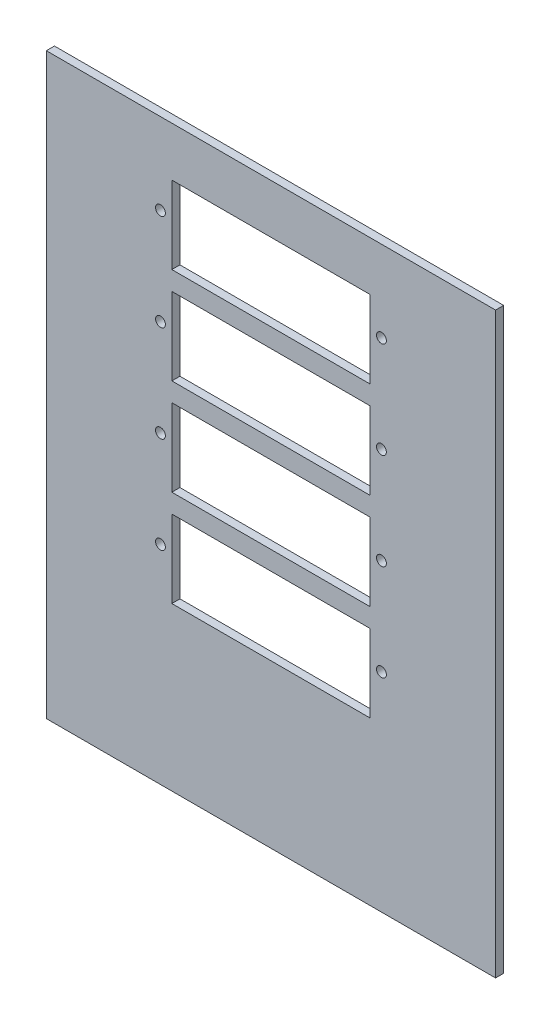
ISO-10303-21;
HEADER;
FILE_DESCRIPTION(('STEP AP214'),'2;1');
FILE_NAME('part.step','',(''),(''),'','','');
FILE_SCHEMA(('AUTOMOTIVE_DESIGN { 1 0 10303 214 1 1 1 1 }'));
ENDSEC;
DATA;
#1=APPLICATION_CONTEXT('core data for automotive mechanical design processes');
#2=APPLICATION_PROTOCOL_DEFINITION('international standard','automotive_design',2000,#1);
#3=PRODUCT_CONTEXT('',#1,'mechanical');
#4=PRODUCT('Part','Part','',(#3));
#5=PRODUCT_RELATED_PRODUCT_CATEGORY('part','',(#4));
#6=PRODUCT_DEFINITION_FORMATION('','',#4);
#7=PRODUCT_DEFINITION_CONTEXT('part definition',#1,'design');
#8=PRODUCT_DEFINITION('design','',#6,#7);
#9=PRODUCT_DEFINITION_SHAPE('','',#8);
#10=(LENGTH_UNIT() NAMED_UNIT(*) SI_UNIT(.MILLI.,.METRE.));
#11=(NAMED_UNIT(*) PLANE_ANGLE_UNIT() SI_UNIT($,.RADIAN.));
#12=(NAMED_UNIT(*) SI_UNIT($,.STERADIAN.) SOLID_ANGLE_UNIT());
#13=UNCERTAINTY_MEASURE_WITH_UNIT(LENGTH_MEASURE(1.E-05),#10,'distance_accuracy_value','');
#14=(GEOMETRIC_REPRESENTATION_CONTEXT(3) GLOBAL_UNCERTAINTY_ASSIGNED_CONTEXT((#13)) GLOBAL_UNIT_ASSIGNED_CONTEXT((#10,
#11,#12)) REPRESENTATION_CONTEXT('',''));
#15=CARTESIAN_POINT('',(0.,0.,0.));
#16=DIRECTION('',(0.,0.,1.));
#17=DIRECTION('',(1.,0.,0.));
#18=AXIS2_PLACEMENT_3D('',#15,#16,#17);
#19=CARTESIAN_POINT('',(-161.832061068702,173.5368956743,4.2));
#20=DIRECTION('',(1.,0.,0.));
#21=DIRECTION('',(0.,1.,0.));
#22=AXIS2_PLACEMENT_3D('',#19,#20,#21);
#23=PLANE('',#22);
#24=DIRECTION('',(0.,-1.,0.));
#25=VECTOR('',#24,1.);
#26=CARTESIAN_POINT('',(-161.832061068702,173.5368956743,0.));
#27=LINE('',#26,#25);
#28=CARTESIAN_POINT('',(-161.832061068702,173.5368956743,0.));
#29=VERTEX_POINT('',#28);
#30=CARTESIAN_POINT('',(-161.832061068702,-126.4631043257,0.));
#31=VERTEX_POINT('',#30);
#32=EDGE_CURVE('E339',#29,#31,#27,.T.);
#33=ORIENTED_EDGE('',*,*,#32,.T.);
#34=DIRECTION('',(0.,0.,-1.));
#35=VECTOR('',#34,1.);
#36=CARTESIAN_POINT('',(-161.832061068702,-126.4631043257,4.2));
#37=LINE('',#36,#35);
#38=CARTESIAN_POINT('',(-161.832061068702,-126.4631043257,4.2));
#39=VERTEX_POINT('',#38);
#40=EDGE_CURVE('E11',#39,#31,#37,.T.);
#41=ORIENTED_EDGE('',*,*,#40,.F.);
#42=DIRECTION('',(0.,-1.,0.));
#43=VECTOR('',#42,1.);
#44=CARTESIAN_POINT('',(-161.832061068702,173.5368956743,4.2));
#45=LINE('',#44,#43);
#46=CARTESIAN_POINT('',(-161.832061068702,173.5368956743,4.2));
#47=VERTEX_POINT('',#46);
#48=EDGE_CURVE('E340',#47,#39,#45,.T.);
#49=ORIENTED_EDGE('',*,*,#48,.F.);
#50=DIRECTION('',(0.,0.,-1.));
#51=VECTOR('',#50,1.);
#52=CARTESIAN_POINT('',(-161.832061068702,173.5368956743,4.2));
#53=LINE('',#52,#51);
#54=EDGE_CURVE('E350',#47,#29,#53,.T.);
#55=ORIENTED_EDGE('',*,*,#54,.T.);
#56=EDGE_LOOP('',(#33,#41,#49,#55));
#57=FACE_BOUND('',#56,.T.);
#58=ADVANCED_FACE('F37',(#57),#23,.F.);
#59=CARTESIAN_POINT('',(-161.832061068702,-126.4631043257,4.2));
#60=DIRECTION('',(0.,1.,0.));
#61=DIRECTION('',(0.,0.,1.));
#62=AXIS2_PLACEMENT_3D('',#59,#60,#61);
#63=PLANE('',#62);
#64=DIRECTION('',(1.,0.,0.));
#65=VECTOR('',#64,1.);
#66=CARTESIAN_POINT('',(-161.832061068702,-126.4631043257,0.));
#67=LINE('',#66,#65);
#68=CARTESIAN_POINT('',(71.1679389312977,-126.4631043257,0.));
#69=VERTEX_POINT('',#68);
#70=EDGE_CURVE('E353',#31,#69,#67,.T.);
#71=ORIENTED_EDGE('',*,*,#70,.T.);
#72=DIRECTION('',(0.,0.,-1.));
#73=VECTOR('',#72,1.);
#74=CARTESIAN_POINT('',(71.1679389312977,-126.4631043257,4.2));
#75=LINE('',#74,#73);
#76=CARTESIAN_POINT('',(71.1679389312977,-126.4631043257,4.2));
#77=VERTEX_POINT('',#76);
#78=EDGE_CURVE('E44',#77,#69,#75,.T.);
#79=ORIENTED_EDGE('',*,*,#78,.F.);
#80=DIRECTION('',(1.,0.,0.));
#81=VECTOR('',#80,1.);
#82=CARTESIAN_POINT('',(-161.832061068702,-126.4631043257,4.2));
#83=LINE('',#82,#81);
#84=EDGE_CURVE('E343',#39,#77,#83,.T.);
#85=ORIENTED_EDGE('',*,*,#84,.F.);
#86=ORIENTED_EDGE('',*,*,#40,.T.);
#87=EDGE_LOOP('',(#71,#79,#85,#86));
#88=FACE_BOUND('',#87,.T.);
#89=ADVANCED_FACE('F382',(#88),#63,.F.);
#90=CARTESIAN_POINT('',(71.1679389312977,173.5368956743,4.2));
#91=DIRECTION('',(-1.,0.,0.));
#92=DIRECTION('',(0.,-1.,0.));
#93=AXIS2_PLACEMENT_3D('',#90,#91,#92);
#94=PLANE('',#93);
#95=DIRECTION('',(0.,1.,0.));
#96=VECTOR('',#95,1.);
#97=CARTESIAN_POINT('',(71.1679389312977,173.5368956743,0.));
#98=LINE('',#97,#96);
#99=CARTESIAN_POINT('',(71.1679389312977,173.5368956743,0.));
#100=VERTEX_POINT('',#99);
#101=EDGE_CURVE('E355',#69,#100,#98,.T.);
#102=ORIENTED_EDGE('',*,*,#101,.T.);
#103=DIRECTION('',(0.,0.,-1.));
#104=VECTOR('',#103,1.);
#105=CARTESIAN_POINT('',(71.1679389312977,173.5368956743,4.2));
#106=LINE('',#105,#104);
#107=CARTESIAN_POINT('',(71.1679389312977,173.5368956743,4.2));
#108=VERTEX_POINT('',#107);
#109=EDGE_CURVE('E360',#108,#100,#106,.T.);
#110=ORIENTED_EDGE('',*,*,#109,.F.);
#111=DIRECTION('',(0.,1.,0.));
#112=VECTOR('',#111,1.);
#113=CARTESIAN_POINT('',(71.1679389312977,173.5368956743,4.2));
#114=LINE('',#113,#112);
#115=EDGE_CURVE('E346',#77,#108,#114,.T.);
#116=ORIENTED_EDGE('',*,*,#115,.F.);
#117=ORIENTED_EDGE('',*,*,#78,.T.);
#118=EDGE_LOOP('',(#102,#110,#116,#117));
#119=FACE_BOUND('',#118,.T.);
#120=ADVANCED_FACE('F367',(#119),#94,.F.);
#121=CARTESIAN_POINT('',(-161.832061068702,173.5368956743,4.2));
#122=DIRECTION('',(0.,-1.,0.));
#123=DIRECTION('',(0.,0.,-1.));
#124=AXIS2_PLACEMENT_3D('',#121,#122,#123);
#125=PLANE('',#124);
#126=DIRECTION('',(-1.,0.,0.));
#127=VECTOR('',#126,1.);
#128=CARTESIAN_POINT('',(-161.832061068702,173.5368956743,0.));
#129=LINE('',#128,#127);
#130=EDGE_CURVE('E344',#100,#29,#129,.T.);
#131=ORIENTED_EDGE('',*,*,#130,.T.);
#132=ORIENTED_EDGE('',*,*,#54,.F.);
#133=DIRECTION('',(-1.,0.,0.));
#134=VECTOR('',#133,1.);
#135=CARTESIAN_POINT('',(-161.832061068702,173.5368956743,4.2));
#136=LINE('',#135,#134);
#137=EDGE_CURVE('E348',#108,#47,#136,.T.);
#138=ORIENTED_EDGE('',*,*,#137,.F.);
#139=ORIENTED_EDGE('',*,*,#109,.T.);
#140=EDGE_LOOP('',(#131,#132,#138,#139));
#141=FACE_BOUND('',#140,.T.);
#142=ADVANCED_FACE('F375',(#141),#125,.F.);
#143=CARTESIAN_POINT('',(0.,0.,4.2));
#144=DIRECTION('',(0.,0.,1.));
#145=DIRECTION('',(1.,0.,0.));
#146=AXIS2_PLACEMENT_3D('',#143,#144,#145);
#147=PLANE('',#146);
#148=CARTESIAN_POINT('',(11.9679389312977,131.4268956743,4.2));
#149=DIRECTION('',(0.,0.,1.));
#150=DIRECTION('',(1.,0.,0.));
#151=AXIS2_PLACEMENT_3D('',#148,#149,#150);
#152=CIRCLE('',#151,2.54999999999999);
#153=CARTESIAN_POINT('',(14.5179389312977,131.4268956743,4.2));
#154=VERTEX_POINT('',#153);
#155=EDGE_CURVE('E336',#154,#154,#152,.T.);
#156=ORIENTED_EDGE('',*,*,#155,.F.);
#157=EDGE_LOOP('',(#156));
#158=FACE_BOUND('',#157,.T.);
#159=CARTESIAN_POINT('',(-102.632061068702,81.4268956743003,4.2));
#160=DIRECTION('',(0.,0.,1.));
#161=DIRECTION('',(1.,0.,0.));
#162=AXIS2_PLACEMENT_3D('',#159,#160,#161);
#163=CIRCLE('',#162,2.54999999999999);
#164=CARTESIAN_POINT('',(-100.082061068702,81.4268956743003,4.2));
#165=VERTEX_POINT('',#164);
#166=EDGE_CURVE('E333',#165,#165,#163,.T.);
#167=ORIENTED_EDGE('',*,*,#166,.F.);
#168=EDGE_LOOP('',(#167));
#169=FACE_BOUND('',#168,.T.);
#170=CARTESIAN_POINT('',(11.9679389312977,81.4268956743003,4.2));
#171=DIRECTION('',(0.,0.,1.));
#172=DIRECTION('',(1.,0.,0.));
#173=AXIS2_PLACEMENT_3D('',#170,#171,#172);
#174=CIRCLE('',#173,2.55);
#175=CARTESIAN_POINT('',(14.5179389312977,81.4268956743003,4.2));
#176=VERTEX_POINT('',#175);
#177=EDGE_CURVE('E330',#176,#176,#174,.T.);
#178=ORIENTED_EDGE('',*,*,#177,.F.);
#179=EDGE_LOOP('',(#178));
#180=FACE_BOUND('',#179,.T.);
#181=CARTESIAN_POINT('',(-102.632061068702,31.4268956743003,4.2));
#182=DIRECTION('',(0.,0.,1.));
#183=DIRECTION('',(1.,0.,0.));
#184=AXIS2_PLACEMENT_3D('',#181,#182,#183);
#185=CIRCLE('',#184,2.54999999999999);
#186=CARTESIAN_POINT('',(-100.082061068702,31.4268956743003,4.2));
#187=VERTEX_POINT('',#186);
#188=EDGE_CURVE('E327',#187,#187,#185,.T.);
#189=ORIENTED_EDGE('',*,*,#188,.F.);
#190=EDGE_LOOP('',(#189));
#191=FACE_BOUND('',#190,.T.);
#192=CARTESIAN_POINT('',(-102.632061068702,131.4268956743,4.2));
#193=DIRECTION('',(0.,0.,1.));
#194=DIRECTION('',(1.,0.,0.));
#195=AXIS2_PLACEMENT_3D('',#192,#193,#194);
#196=CIRCLE('',#195,2.54999999999999);
#197=CARTESIAN_POINT('',(-100.082061068702,131.4268956743,4.2));
#198=VERTEX_POINT('',#197);
#199=EDGE_CURVE('E324',#198,#198,#196,.T.);
#200=ORIENTED_EDGE('',*,*,#199,.F.);
#201=EDGE_LOOP('',(#200));
#202=FACE_BOUND('',#201,.T.);
#203=DIRECTION('',(0.,-1.,0.));
#204=VECTOR('',#203,1.);
#205=CARTESIAN_POINT('',(-96.7320610687023,0.,4.2));
#206=LINE('',#205,#204);
#207=CARTESIAN_POINT('',(-96.7320610687023,147.9768956743,4.2));
#208=VERTEX_POINT('',#207);
#209=CARTESIAN_POINT('',(-96.7320610687023,107.7768956743,4.2));
#210=VERTEX_POINT('',#209);
#211=EDGE_CURVE('E322',#208,#210,#206,.T.);
#212=ORIENTED_EDGE('',*,*,#211,.F.);
#213=DIRECTION('',(-1.,0.,0.));
#214=VECTOR('',#213,1.);
#215=CARTESIAN_POINT('',(0.,147.9768956743,4.2));
#216=LINE('',#215,#214);
#217=CARTESIAN_POINT('',(6.06793893129769,147.9768956743,4.2));
#218=VERTEX_POINT('',#217);
#219=EDGE_CURVE('E320',#218,#208,#216,.T.);
#220=ORIENTED_EDGE('',*,*,#219,.F.);
#221=DIRECTION('',(0.,1.,0.));
#222=VECTOR('',#221,1.);
#223=CARTESIAN_POINT('',(6.06793893129771,0.,4.2));
#224=LINE('',#223,#222);
#225=CARTESIAN_POINT('',(6.0679389312977,107.7768956743,4.2));
#226=VERTEX_POINT('',#225);
#227=EDGE_CURVE('E318',#226,#218,#224,.T.);
#228=ORIENTED_EDGE('',*,*,#227,.F.);
#229=DIRECTION('',(1.,0.,0.));
#230=VECTOR('',#229,1.);
#231=CARTESIAN_POINT('',(0.,107.7768956743,4.2));
#232=LINE('',#231,#230);
#233=EDGE_CURVE('E316',#210,#226,#232,.T.);
#234=ORIENTED_EDGE('',*,*,#233,.F.);
#235=EDGE_LOOP('',(#212,#220,#228,#234));
#236=FACE_BOUND('',#235,.T.);
#237=DIRECTION('',(0.,-1.,0.));
#238=VECTOR('',#237,1.);
#239=CARTESIAN_POINT('',(-96.7320610687023,0.,4.2));
#240=LINE('',#239,#238);
#241=CARTESIAN_POINT('',(-96.7320610687023,97.9768956743003,4.2));
#242=VERTEX_POINT('',#241);
#243=CARTESIAN_POINT('',(-96.7320610687023,57.7768956743003,4.2));
#244=VERTEX_POINT('',#243);
#245=EDGE_CURVE('E314',#242,#244,#240,.T.);
#246=ORIENTED_EDGE('',*,*,#245,.F.);
#247=DIRECTION('',(-1.,0.,0.));
#248=VECTOR('',#247,1.);
#249=CARTESIAN_POINT('',(0.,97.9768956743003,4.2));
#250=LINE('',#249,#248);
#251=CARTESIAN_POINT('',(6.06793893129772,97.9768956743003,4.2));
#252=VERTEX_POINT('',#251);
#253=EDGE_CURVE('E312',#252,#242,#250,.T.);
#254=ORIENTED_EDGE('',*,*,#253,.F.);
#255=DIRECTION('',(0.,1.,0.));
#256=VECTOR('',#255,1.);
#257=CARTESIAN_POINT('',(6.06793893129773,0.,4.2));
#258=LINE('',#257,#256);
#259=CARTESIAN_POINT('',(6.06793893129772,57.7768956743003,4.2));
#260=VERTEX_POINT('',#259);
#261=EDGE_CURVE('E310',#260,#252,#258,.T.);
#262=ORIENTED_EDGE('',*,*,#261,.F.);
#263=DIRECTION('',(1.,0.,0.));
#264=VECTOR('',#263,1.);
#265=CARTESIAN_POINT('',(0.,57.7768956743003,4.2));
#266=LINE('',#265,#264);
#267=EDGE_CURVE('E308',#244,#260,#266,.T.);
#268=ORIENTED_EDGE('',*,*,#267,.F.);
#269=EDGE_LOOP('',(#246,#254,#262,#268));
#270=FACE_BOUND('',#269,.T.);
#271=DIRECTION('',(0.,-1.,0.));
#272=VECTOR('',#271,1.);
#273=CARTESIAN_POINT('',(-96.7320610687023,0.,4.2));
#274=LINE('',#273,#272);
#275=CARTESIAN_POINT('',(-96.7320610687023,47.9768956743003,4.2));
#276=VERTEX_POINT('',#275);
#277=CARTESIAN_POINT('',(-96.7320610687023,7.77689567430029,4.2));
#278=VERTEX_POINT('',#277);
#279=EDGE_CURVE('E181',#276,#278,#274,.T.);
#280=ORIENTED_EDGE('',*,*,#279,.F.);
#281=DIRECTION('',(-1.,0.,0.));
#282=VECTOR('',#281,1.);
#283=CARTESIAN_POINT('',(0.,47.9768956743003,4.2));
#284=LINE('',#283,#282);
#285=CARTESIAN_POINT('',(6.06793893129772,47.9768956743003,4.2));
#286=VERTEX_POINT('',#285);
#287=EDGE_CURVE('E305',#286,#276,#284,.T.);
#288=ORIENTED_EDGE('',*,*,#287,.F.);
#289=DIRECTION('',(0.,1.,0.));
#290=VECTOR('',#289,1.);
#291=CARTESIAN_POINT('',(6.06793893129772,0.,4.2));
#292=LINE('',#291,#290);
#293=CARTESIAN_POINT('',(6.06793893129772,7.77689567430029,4.2));
#294=VERTEX_POINT('',#293);
#295=EDGE_CURVE('E303',#294,#286,#292,.T.);
#296=ORIENTED_EDGE('',*,*,#295,.F.);
#297=DIRECTION('',(1.,0.,0.));
#298=VECTOR('',#297,1.);
#299=CARTESIAN_POINT('',(0.,7.77689567430029,4.2));
#300=LINE('',#299,#298);
#301=EDGE_CURVE('E301',#278,#294,#300,.T.);
#302=ORIENTED_EDGE('',*,*,#301,.F.);
#303=EDGE_LOOP('',(#280,#288,#296,#302));
#304=FACE_BOUND('',#303,.T.);
#305=CARTESIAN_POINT('',(11.9679389312977,-18.5731043256997,4.2));
#306=DIRECTION('',(0.,0.,1.));
#307=DIRECTION('',(1.,0.,0.));
#308=AXIS2_PLACEMENT_3D('',#305,#306,#307);
#309=CIRCLE('',#308,2.54999999999999);
#310=CARTESIAN_POINT('',(14.5179389312977,-18.5731043256997,4.2));
#311=VERTEX_POINT('',#310);
#312=EDGE_CURVE('E298',#311,#311,#309,.T.);
#313=ORIENTED_EDGE('',*,*,#312,.F.);
#314=EDGE_LOOP('',(#313));
#315=FACE_BOUND('',#314,.T.);
#316=CARTESIAN_POINT('',(-102.632061068702,-18.5731043256997,4.2));
#317=DIRECTION('',(0.,0.,1.));
#318=DIRECTION('',(1.,0.,0.));
#319=AXIS2_PLACEMENT_3D('',#316,#317,#318);
#320=CIRCLE('',#319,2.54999999999999);
#321=CARTESIAN_POINT('',(-100.082061068702,-18.5731043256997,4.2));
#322=VERTEX_POINT('',#321);
#323=EDGE_CURVE('E295',#322,#322,#320,.T.);
#324=ORIENTED_EDGE('',*,*,#323,.F.);
#325=EDGE_LOOP('',(#324));
#326=FACE_BOUND('',#325,.T.);
#327=CARTESIAN_POINT('',(11.9679389312977,31.4268956743003,4.2));
#328=DIRECTION('',(0.,0.,1.));
#329=DIRECTION('',(1.,0.,0.));
#330=AXIS2_PLACEMENT_3D('',#327,#328,#329);
#331=CIRCLE('',#330,2.54999999999999);
#332=CARTESIAN_POINT('',(14.5179389312977,31.4268956743003,4.2));
#333=VERTEX_POINT('',#332);
#334=EDGE_CURVE('E292',#333,#333,#331,.T.);
#335=ORIENTED_EDGE('',*,*,#334,.F.);
#336=EDGE_LOOP('',(#335));
#337=FACE_BOUND('',#336,.T.);
#338=DIRECTION('',(0.,-1.,0.));
#339=VECTOR('',#338,1.);
#340=CARTESIAN_POINT('',(-96.7320610687023,0.,4.2));
#341=LINE('',#340,#339);
#342=CARTESIAN_POINT('',(-96.7320610687023,-2.02310432569972,4.2));
#343=VERTEX_POINT('',#342);
#344=CARTESIAN_POINT('',(-96.7320610687023,-42.2231043256997,4.2));
#345=VERTEX_POINT('',#344);
#346=EDGE_CURVE('E289',#343,#345,#341,.T.);
#347=ORIENTED_EDGE('',*,*,#346,.F.);
#348=DIRECTION('',(-1.,0.,0.));
#349=VECTOR('',#348,1.);
#350=CARTESIAN_POINT('',(0.,-2.02310432569972,4.2));
#351=LINE('',#350,#349);
#352=CARTESIAN_POINT('',(6.06793893129773,-2.02310432569972,4.2));
#353=VERTEX_POINT('',#352);
#354=EDGE_CURVE('E287',#353,#343,#351,.T.);
#355=ORIENTED_EDGE('',*,*,#354,.F.);
#356=DIRECTION('',(0.,1.,0.));
#357=VECTOR('',#356,1.);
#358=CARTESIAN_POINT('',(6.06793893129773,0.,4.2));
#359=LINE('',#358,#357);
#360=CARTESIAN_POINT('',(6.06793893129773,-42.2231043256997,4.2));
#361=VERTEX_POINT('',#360);
#362=EDGE_CURVE('E285',#361,#353,#359,.T.);
#363=ORIENTED_EDGE('',*,*,#362,.F.);
#364=DIRECTION('',(1.,0.,0.));
#365=VECTOR('',#364,1.);
#366=CARTESIAN_POINT('',(0.,-42.2231043256997,4.2));
#367=LINE('',#366,#365);
#368=EDGE_CURVE('E276',#345,#361,#367,.T.);
#369=ORIENTED_EDGE('',*,*,#368,.F.);
#370=EDGE_LOOP('',(#347,#355,#363,#369));
#371=FACE_BOUND('',#370,.T.);
#372=ORIENTED_EDGE('',*,*,#48,.T.);
#373=ORIENTED_EDGE('',*,*,#84,.T.);
#374=ORIENTED_EDGE('',*,*,#115,.T.);
#375=ORIENTED_EDGE('',*,*,#137,.T.);
#376=EDGE_LOOP('',(#372,#373,#374,#375));
#377=FACE_BOUND('',#376,.T.);
#378=ADVANCED_FACE('F381',(#158,#169,#180,#191,#202,#236,#270,#304,#315,#326,#337,#371,#377),
#147,.T.);
#379=CARTESIAN_POINT('',(0.,0.,0.));
#380=DIRECTION('',(0.,0.,1.));
#381=DIRECTION('',(1.,0.,0.));
#382=AXIS2_PLACEMENT_3D('',#379,#380,#381);
#383=PLANE('',#382);
#384=CARTESIAN_POINT('',(11.9679389312977,131.4268956743,0.));
#385=DIRECTION('',(0.,0.,1.));
#386=DIRECTION('',(1.,0.,0.));
#387=AXIS2_PLACEMENT_3D('',#384,#385,#386);
#388=CIRCLE('',#387,2.54999999999999);
#389=CARTESIAN_POINT('',(14.5179389312977,131.4268956743,0.));
#390=VERTEX_POINT('',#389);
#391=EDGE_CURVE('E260',#390,#390,#388,.T.);
#392=ORIENTED_EDGE('',*,*,#391,.T.);
#393=EDGE_LOOP('',(#392));
#394=FACE_BOUND('',#393,.T.);
#395=CARTESIAN_POINT('',(-102.632061068702,81.4268956743003,0.));
#396=DIRECTION('',(0.,0.,1.));
#397=DIRECTION('',(1.,0.,0.));
#398=AXIS2_PLACEMENT_3D('',#395,#396,#397);
#399=CIRCLE('',#398,2.54999999999999);
#400=CARTESIAN_POINT('',(-100.082061068702,81.4268956743003,0.));
#401=VERTEX_POINT('',#400);
#402=EDGE_CURVE('E205',#401,#401,#399,.T.);
#403=ORIENTED_EDGE('',*,*,#402,.T.);
#404=EDGE_LOOP('',(#403));
#405=FACE_BOUND('',#404,.T.);
#406=CARTESIAN_POINT('',(11.9679389312977,81.4268956743003,0.));
#407=DIRECTION('',(0.,0.,1.));
#408=DIRECTION('',(1.,0.,0.));
#409=AXIS2_PLACEMENT_3D('',#406,#407,#408);
#410=CIRCLE('',#409,2.55);
#411=CARTESIAN_POINT('',(14.5179389312977,81.4268956743003,0.));
#412=VERTEX_POINT('',#411);
#413=EDGE_CURVE('E503',#412,#412,#410,.T.);
#414=ORIENTED_EDGE('',*,*,#413,.T.);
#415=EDGE_LOOP('',(#414));
#416=FACE_BOUND('',#415,.T.);
#417=CARTESIAN_POINT('',(-102.632061068702,31.4268956743003,0.));
#418=DIRECTION('',(0.,0.,1.));
#419=DIRECTION('',(1.,0.,0.));
#420=AXIS2_PLACEMENT_3D('',#417,#418,#419);
#421=CIRCLE('',#420,2.54999999999999);
#422=CARTESIAN_POINT('',(-100.082061068702,31.4268956743003,0.));
#423=VERTEX_POINT('',#422);
#424=EDGE_CURVE('E501',#423,#423,#421,.T.);
#425=ORIENTED_EDGE('',*,*,#424,.T.);
#426=EDGE_LOOP('',(#425));
#427=FACE_BOUND('',#426,.T.);
#428=CARTESIAN_POINT('',(-102.632061068702,131.4268956743,0.));
#429=DIRECTION('',(0.,0.,1.));
#430=DIRECTION('',(1.,0.,0.));
#431=AXIS2_PLACEMENT_3D('',#428,#429,#430);
#432=CIRCLE('',#431,2.54999999999999);
#433=CARTESIAN_POINT('',(-100.082061068702,131.4268956743,0.));
#434=VERTEX_POINT('',#433);
#435=EDGE_CURVE('E240',#434,#434,#432,.T.);
#436=ORIENTED_EDGE('',*,*,#435,.T.);
#437=EDGE_LOOP('',(#436));
#438=FACE_BOUND('',#437,.T.);
#439=DIRECTION('',(-1.,0.,0.));
#440=VECTOR('',#439,1.);
#441=CARTESIAN_POINT('',(-96.7320610687023,147.9768956743,0.));
#442=LINE('',#441,#440);
#443=CARTESIAN_POINT('',(6.06793893129769,147.9768956743,0.));
#444=VERTEX_POINT('',#443);
#445=CARTESIAN_POINT('',(-96.7320610687023,147.9768956743,0.));
#446=VERTEX_POINT('',#445);
#447=EDGE_CURVE('E246',#444,#446,#442,.T.);
#448=ORIENTED_EDGE('',*,*,#447,.T.);
#449=DIRECTION('',(0.,-1.,0.));
#450=VECTOR('',#449,1.);
#451=CARTESIAN_POINT('',(-96.7320610687023,147.9768956743,0.));
#452=LINE('',#451,#450);
#453=CARTESIAN_POINT('',(-96.7320610687023,107.7768956743,0.));
#454=VERTEX_POINT('',#453);
#455=EDGE_CURVE('E236',#446,#454,#452,.T.);
#456=ORIENTED_EDGE('',*,*,#455,.T.);
#457=DIRECTION('',(1.,0.,0.));
#458=VECTOR('',#457,1.);
#459=CARTESIAN_POINT('',(-96.7320610687023,107.7768956743,0.));
#460=LINE('',#459,#458);
#461=CARTESIAN_POINT('',(6.0679389312977,107.7768956743,0.));
#462=VERTEX_POINT('',#461);
#463=EDGE_CURVE('E239',#454,#462,#460,.T.);
#464=ORIENTED_EDGE('',*,*,#463,.T.);
#465=DIRECTION('',(0.,1.,0.));
#466=VECTOR('',#465,1.);
#467=CARTESIAN_POINT('',(6.06793893129769,147.9768956743,0.));
#468=LINE('',#467,#466);
#469=EDGE_CURVE('E243',#462,#444,#468,.T.);
#470=ORIENTED_EDGE('',*,*,#469,.T.);
#471=EDGE_LOOP('',(#448,#456,#464,#470));
#472=FACE_BOUND('',#471,.T.);
#473=DIRECTION('',(-1.,0.,0.));
#474=VECTOR('',#473,1.);
#475=CARTESIAN_POINT('',(-96.7320610687023,97.9768956743003,0.));
#476=LINE('',#475,#474);
#477=CARTESIAN_POINT('',(6.06793893129772,97.9768956743003,0.));
#478=VERTEX_POINT('',#477);
#479=CARTESIAN_POINT('',(-96.7320610687023,97.9768956743003,0.));
#480=VERTEX_POINT('',#479);
#481=EDGE_CURVE('E227',#478,#480,#476,.T.);
#482=ORIENTED_EDGE('',*,*,#481,.T.);
#483=DIRECTION('',(0.,-1.,0.));
#484=VECTOR('',#483,1.);
#485=CARTESIAN_POINT('',(-96.7320610687023,97.9768956743003,0.));
#486=LINE('',#485,#484);
#487=CARTESIAN_POINT('',(-96.7320610687023,57.7768956743003,0.));
#488=VERTEX_POINT('',#487);
#489=EDGE_CURVE('E217',#480,#488,#486,.T.);
#490=ORIENTED_EDGE('',*,*,#489,.T.);
#491=DIRECTION('',(1.,0.,0.));
#492=VECTOR('',#491,1.);
#493=CARTESIAN_POINT('',(-96.7320610687023,57.7768956743003,0.));
#494=LINE('',#493,#492);
#495=CARTESIAN_POINT('',(6.06793893129772,57.7768956743003,0.));
#496=VERTEX_POINT('',#495);
#497=EDGE_CURVE('E220',#488,#496,#494,.T.);
#498=ORIENTED_EDGE('',*,*,#497,.T.);
#499=DIRECTION('',(0.,1.,0.));
#500=VECTOR('',#499,1.);
#501=CARTESIAN_POINT('',(6.06793893129772,97.9768956743003,0.));
#502=LINE('',#501,#500);
#503=EDGE_CURVE('E224',#496,#478,#502,.T.);
#504=ORIENTED_EDGE('',*,*,#503,.T.);
#505=EDGE_LOOP('',(#482,#490,#498,#504));
#506=FACE_BOUND('',#505,.T.);
#507=DIRECTION('',(-1.,0.,0.));
#508=VECTOR('',#507,1.);
#509=CARTESIAN_POINT('',(-96.7320610687023,47.9768956743003,0.));
#510=LINE('',#509,#508);
#511=CARTESIAN_POINT('',(6.06793893129772,47.9768956743003,0.));
#512=VERTEX_POINT('',#511);
#513=CARTESIAN_POINT('',(-96.7320610687023,47.9768956743003,0.));
#514=VERTEX_POINT('',#513);
#515=EDGE_CURVE('E185',#512,#514,#510,.T.);
#516=ORIENTED_EDGE('',*,*,#515,.T.);
#517=DIRECTION('',(0.,-1.,0.));
#518=VECTOR('',#517,1.);
#519=CARTESIAN_POINT('',(-96.7320610687023,47.9768956743003,0.));
#520=LINE('',#519,#518);
#521=CARTESIAN_POINT('',(-96.7320610687023,7.77689567430029,0.));
#522=VERTEX_POINT('',#521);
#523=EDGE_CURVE('E178',#514,#522,#520,.T.);
#524=ORIENTED_EDGE('',*,*,#523,.T.);
#525=DIRECTION('',(1.,0.,0.));
#526=VECTOR('',#525,1.);
#527=CARTESIAN_POINT('',(-96.7320610687023,7.77689567430029,0.));
#528=LINE('',#527,#526);
#529=CARTESIAN_POINT('',(6.06793893129772,7.77689567430029,0.));
#530=VERTEX_POINT('',#529);
#531=EDGE_CURVE('E189',#522,#530,#528,.T.);
#532=ORIENTED_EDGE('',*,*,#531,.T.);
#533=DIRECTION('',(0.,1.,0.));
#534=VECTOR('',#533,1.);
#535=CARTESIAN_POINT('',(6.06793893129772,47.9768956743003,0.));
#536=LINE('',#535,#534);
#537=EDGE_CURVE('E194',#530,#512,#536,.T.);
#538=ORIENTED_EDGE('',*,*,#537,.T.);
#539=EDGE_LOOP('',(#516,#524,#532,#538));
#540=FACE_BOUND('',#539,.T.);
#541=CARTESIAN_POINT('',(11.9679389312977,-18.5731043256997,0.));
#542=DIRECTION('',(0.,0.,1.));
#543=DIRECTION('',(1.,0.,0.));
#544=AXIS2_PLACEMENT_3D('',#541,#542,#543);
#545=CIRCLE('',#544,2.54999999999999);
#546=CARTESIAN_POINT('',(14.5179389312977,-18.5731043256997,0.));
#547=VERTEX_POINT('',#546);
#548=EDGE_CURVE('E493',#547,#547,#545,.T.);
#549=ORIENTED_EDGE('',*,*,#548,.T.);
#550=EDGE_LOOP('',(#549));
#551=FACE_BOUND('',#550,.T.);
#552=CARTESIAN_POINT('',(-102.632061068702,-18.5731043256997,0.));
#553=DIRECTION('',(0.,0.,1.));
#554=DIRECTION('',(1.,0.,0.));
#555=AXIS2_PLACEMENT_3D('',#552,#553,#554);
#556=CIRCLE('',#555,2.54999999999999);
#557=CARTESIAN_POINT('',(-100.082061068702,-18.5731043256997,0.));
#558=VERTEX_POINT('',#557);
#559=EDGE_CURVE('E494',#558,#558,#556,.T.);
#560=ORIENTED_EDGE('',*,*,#559,.T.);
#561=EDGE_LOOP('',(#560));
#562=FACE_BOUND('',#561,.T.);
#563=CARTESIAN_POINT('',(11.9679389312977,31.4268956743003,0.));
#564=DIRECTION('',(0.,0.,1.));
#565=DIRECTION('',(1.,0.,0.));
#566=AXIS2_PLACEMENT_3D('',#563,#564,#565);
#567=CIRCLE('',#566,2.54999999999999);
#568=CARTESIAN_POINT('',(14.5179389312977,31.4268956743003,0.));
#569=VERTEX_POINT('',#568);
#570=EDGE_CURVE('E497',#569,#569,#567,.T.);
#571=ORIENTED_EDGE('',*,*,#570,.T.);
#572=EDGE_LOOP('',(#571));
#573=FACE_BOUND('',#572,.T.);
#574=DIRECTION('',(-1.,0.,0.));
#575=VECTOR('',#574,1.);
#576=CARTESIAN_POINT('',(-96.7320610687023,-2.02310432569972,0.));
#577=LINE('',#576,#575);
#578=CARTESIAN_POINT('',(6.06793893129773,-2.02310432569972,0.));
#579=VERTEX_POINT('',#578);
#580=CARTESIAN_POINT('',(-96.7320610687023,-2.02310432569972,0.));
#581=VERTEX_POINT('',#580);
#582=EDGE_CURVE('E269',#579,#581,#577,.T.);
#583=ORIENTED_EDGE('',*,*,#582,.T.);
#584=DIRECTION('',(0.,-1.,0.));
#585=VECTOR('',#584,1.);
#586=CARTESIAN_POINT('',(-96.7320610687023,-2.02310432569972,0.));
#587=LINE('',#586,#585);
#588=CARTESIAN_POINT('',(-96.7320610687023,-42.2231043256997,0.));
#589=VERTEX_POINT('',#588);
#590=EDGE_CURVE('E212',#581,#589,#587,.T.);
#591=ORIENTED_EDGE('',*,*,#590,.T.);
#592=DIRECTION('',(1.,0.,0.));
#593=VECTOR('',#592,1.);
#594=CARTESIAN_POINT('',(-96.7320610687023,-42.2231043256997,0.));
#595=LINE('',#594,#593);
#596=CARTESIAN_POINT('',(6.06793893129773,-42.2231043256997,0.));
#597=VERTEX_POINT('',#596);
#598=EDGE_CURVE('E263',#589,#597,#595,.T.);
#599=ORIENTED_EDGE('',*,*,#598,.T.);
#600=DIRECTION('',(0.,1.,0.));
#601=VECTOR('',#600,1.);
#602=CARTESIAN_POINT('',(6.06793893129773,-2.02310432569972,0.));
#603=LINE('',#602,#601);
#604=EDGE_CURVE('E266',#597,#579,#603,.T.);
#605=ORIENTED_EDGE('',*,*,#604,.T.);
#606=EDGE_LOOP('',(#583,#591,#599,#605));
#607=FACE_BOUND('',#606,.T.);
#608=ORIENTED_EDGE('',*,*,#32,.F.);
#609=ORIENTED_EDGE('',*,*,#130,.F.);
#610=ORIENTED_EDGE('',*,*,#101,.F.);
#611=ORIENTED_EDGE('',*,*,#70,.F.);
#612=EDGE_LOOP('',(#608,#609,#610,#611));
#613=FACE_BOUND('',#612,.T.);
#614=ADVANCED_FACE('F196',(#394,#405,#416,#427,#438,#472,#506,#540,#551,#562,#573,#607,#613),
#383,.F.);
#615=CARTESIAN_POINT('',(-96.7320610687023,-2.02310432569972,0.));
#616=DIRECTION('',(-1.,0.,0.));
#617=DIRECTION('',(0.,0.,1.));
#618=AXIS2_PLACEMENT_3D('',#615,#616,#617);
#619=PLANE('',#618);
#620=ORIENTED_EDGE('',*,*,#346,.T.);
#621=DIRECTION('',(0.,0.,1.));
#622=VECTOR('',#621,1.);
#623=CARTESIAN_POINT('',(-96.7320610687023,-42.2231043256997,0.));
#624=LINE('',#623,#622);
#625=EDGE_CURVE('E272',#589,#345,#624,.T.);
#626=ORIENTED_EDGE('',*,*,#625,.F.);
#627=ORIENTED_EDGE('',*,*,#590,.F.);
#628=DIRECTION('',(0.,0.,1.));
#629=VECTOR('',#628,1.);
#630=CARTESIAN_POINT('',(-96.7320610687023,-2.02310432569972,0.));
#631=LINE('',#630,#629);
#632=EDGE_CURVE('E273',#581,#343,#631,.T.);
#633=ORIENTED_EDGE('',*,*,#632,.T.);
#634=EDGE_LOOP('',(#620,#626,#627,#633));
#635=FACE_BOUND('',#634,.T.);
#636=ADVANCED_FACE('F394',(#635),#619,.F.);
#637=CARTESIAN_POINT('',(-96.7320610687023,-2.02310432569972,0.));
#638=DIRECTION('',(0.,1.,0.));
#639=DIRECTION('',(0.,0.,1.));
#640=AXIS2_PLACEMENT_3D('',#637,#638,#639);
#641=PLANE('',#640);
#642=ORIENTED_EDGE('',*,*,#354,.T.);
#643=ORIENTED_EDGE('',*,*,#632,.F.);
#644=ORIENTED_EDGE('',*,*,#582,.F.);
#645=DIRECTION('',(0.,0.,1.));
#646=VECTOR('',#645,1.);
#647=CARTESIAN_POINT('',(6.06793893129773,-2.02310432569972,0.));
#648=LINE('',#647,#646);
#649=EDGE_CURVE('E277',#579,#353,#648,.T.);
#650=ORIENTED_EDGE('',*,*,#649,.T.);
#651=EDGE_LOOP('',(#642,#643,#644,#650));
#652=FACE_BOUND('',#651,.T.);
#653=ADVANCED_FACE('F401',(#652),#641,.F.);
#654=CARTESIAN_POINT('',(6.06793893129773,-2.02310432569972,0.));
#655=DIRECTION('',(1.,0.,0.));
#656=DIRECTION('',(0.,1.,0.));
#657=AXIS2_PLACEMENT_3D('',#654,#655,#656);
#658=PLANE('',#657);
#659=ORIENTED_EDGE('',*,*,#362,.T.);
#660=ORIENTED_EDGE('',*,*,#649,.F.);
#661=ORIENTED_EDGE('',*,*,#604,.F.);
#662=DIRECTION('',(0.,0.,1.));
#663=VECTOR('',#662,1.);
#664=CARTESIAN_POINT('',(6.06793893129773,-42.2231043256997,0.));
#665=LINE('',#664,#663);
#666=EDGE_CURVE('E280',#597,#361,#665,.T.);
#667=ORIENTED_EDGE('',*,*,#666,.T.);
#668=EDGE_LOOP('',(#659,#660,#661,#667));
#669=FACE_BOUND('',#668,.T.);
#670=ADVANCED_FACE('F407',(#669),#658,.F.);
#671=CARTESIAN_POINT('',(-96.7320610687023,-42.2231043256997,0.));
#672=DIRECTION('',(0.,-1.,0.));
#673=DIRECTION('',(0.,0.,-1.));
#674=AXIS2_PLACEMENT_3D('',#671,#672,#673);
#675=PLANE('',#674);
#676=ORIENTED_EDGE('',*,*,#368,.T.);
#677=ORIENTED_EDGE('',*,*,#666,.F.);
#678=ORIENTED_EDGE('',*,*,#598,.F.);
#679=ORIENTED_EDGE('',*,*,#625,.T.);
#680=EDGE_LOOP('',(#676,#677,#678,#679));
#681=FACE_BOUND('',#680,.T.);
#682=ADVANCED_FACE('F403',(#681),#675,.F.);
#683=CARTESIAN_POINT('',(11.9679389312977,31.4268956743003,0.));
#684=DIRECTION('',(0.,0.,1.));
#685=DIRECTION('',(1.,0.,0.));
#686=AXIS2_PLACEMENT_3D('',#683,#684,#685);
#687=CYLINDRICAL_SURFACE('',#686,2.54999999999999);
#688=ORIENTED_EDGE('',*,*,#334,.T.);
#689=EDGE_LOOP('',(#688));
#690=FACE_BOUND('',#689,.T.);
#691=ORIENTED_EDGE('',*,*,#570,.F.);
#692=EDGE_LOOP('',(#691));
#693=FACE_BOUND('',#692,.T.);
#694=ADVANCED_FACE('F406',(#690,#693),#687,.F.);
#695=CARTESIAN_POINT('',(-102.632061068702,-18.5731043256997,0.));
#696=DIRECTION('',(0.,0.,1.));
#697=DIRECTION('',(1.,0.,0.));
#698=AXIS2_PLACEMENT_3D('',#695,#696,#697);
#699=CYLINDRICAL_SURFACE('',#698,2.54999999999999);
#700=ORIENTED_EDGE('',*,*,#323,.T.);
#701=EDGE_LOOP('',(#700));
#702=FACE_BOUND('',#701,.T.);
#703=ORIENTED_EDGE('',*,*,#559,.F.);
#704=EDGE_LOOP('',(#703));
#705=FACE_BOUND('',#704,.T.);
#706=ADVANCED_FACE('F478',(#702,#705),#699,.F.);
#707=CARTESIAN_POINT('',(11.9679389312977,-18.5731043256997,0.));
#708=DIRECTION('',(0.,0.,1.));
#709=DIRECTION('',(1.,0.,0.));
#710=AXIS2_PLACEMENT_3D('',#707,#708,#709);
#711=CYLINDRICAL_SURFACE('',#710,2.54999999999999);
#712=ORIENTED_EDGE('',*,*,#312,.T.);
#713=EDGE_LOOP('',(#712));
#714=FACE_BOUND('',#713,.T.);
#715=ORIENTED_EDGE('',*,*,#548,.F.);
#716=EDGE_LOOP('',(#715));
#717=FACE_BOUND('',#716,.T.);
#718=ADVANCED_FACE('F453',(#714,#717),#711,.F.);
#719=CARTESIAN_POINT('',(-96.7320610687023,47.9768956743003,0.));
#720=DIRECTION('',(-1.,0.,0.));
#721=DIRECTION('',(0.,0.,1.));
#722=AXIS2_PLACEMENT_3D('',#719,#720,#721);
#723=PLANE('',#722);
#724=ORIENTED_EDGE('',*,*,#279,.T.);
#725=DIRECTION('',(0.,0.,1.));
#726=VECTOR('',#725,1.);
#727=CARTESIAN_POINT('',(-96.7320610687023,7.77689567430029,0.));
#728=LINE('',#727,#726);
#729=EDGE_CURVE('E173',#522,#278,#728,.T.);
#730=ORIENTED_EDGE('',*,*,#729,.F.);
#731=ORIENTED_EDGE('',*,*,#523,.F.);
#732=DIRECTION('',(0.,0.,1.));
#733=VECTOR('',#732,1.);
#734=CARTESIAN_POINT('',(-96.7320610687023,47.9768956743003,0.));
#735=LINE('',#734,#733);
#736=EDGE_CURVE('E210',#514,#276,#735,.T.);
#737=ORIENTED_EDGE('',*,*,#736,.T.);
#738=EDGE_LOOP('',(#724,#730,#731,#737));
#739=FACE_BOUND('',#738,.T.);
#740=ADVANCED_FACE('F175',(#739),#723,.F.);
#741=CARTESIAN_POINT('',(-96.7320610687023,47.9768956743003,0.));
#742=DIRECTION('',(0.,1.,0.));
#743=DIRECTION('',(-1.,0.,0.));
#744=AXIS2_PLACEMENT_3D('',#741,#742,#743);
#745=PLANE('',#744);
#746=ORIENTED_EDGE('',*,*,#287,.T.);
#747=ORIENTED_EDGE('',*,*,#736,.F.);
#748=ORIENTED_EDGE('',*,*,#515,.F.);
#749=DIRECTION('',(0.,0.,1.));
#750=VECTOR('',#749,1.);
#751=CARTESIAN_POINT('',(6.06793893129772,47.9768956743003,0.));
#752=LINE('',#751,#750);
#753=EDGE_CURVE('E213',#512,#286,#752,.T.);
#754=ORIENTED_EDGE('',*,*,#753,.T.);
#755=EDGE_LOOP('',(#746,#747,#748,#754));
#756=FACE_BOUND('',#755,.T.);
#757=ADVANCED_FACE('F452',(#756),#745,.F.);
#758=CARTESIAN_POINT('',(6.06793893129772,47.9768956743003,0.));
#759=DIRECTION('',(1.,0.,0.));
#760=DIRECTION('',(0.,1.,0.));
#761=AXIS2_PLACEMENT_3D('',#758,#759,#760);
#762=PLANE('',#761);
#763=ORIENTED_EDGE('',*,*,#295,.T.);
#764=ORIENTED_EDGE('',*,*,#753,.F.);
#765=ORIENTED_EDGE('',*,*,#537,.F.);
#766=DIRECTION('',(0.,0.,1.));
#767=VECTOR('',#766,1.);
#768=CARTESIAN_POINT('',(6.06793893129772,7.77689567430029,0.));
#769=LINE('',#768,#767);
#770=EDGE_CURVE('E184',#530,#294,#769,.T.);
#771=ORIENTED_EDGE('',*,*,#770,.T.);
#772=EDGE_LOOP('',(#763,#764,#765,#771));
#773=FACE_BOUND('',#772,.T.);
#774=ADVANCED_FACE('F456',(#773),#762,.F.);
#775=CARTESIAN_POINT('',(-96.7320610687023,7.77689567430029,0.));
#776=DIRECTION('',(0.,-1.,0.));
#777=DIRECTION('',(0.,0.,-1.));
#778=AXIS2_PLACEMENT_3D('',#775,#776,#777);
#779=PLANE('',#778);
#780=ORIENTED_EDGE('',*,*,#301,.T.);
#781=ORIENTED_EDGE('',*,*,#770,.F.);
#782=ORIENTED_EDGE('',*,*,#531,.F.);
#783=ORIENTED_EDGE('',*,*,#729,.T.);
#784=EDGE_LOOP('',(#780,#781,#782,#783));
#785=FACE_BOUND('',#784,.T.);
#786=ADVANCED_FACE('F190',(#785),#779,.F.);
#787=CARTESIAN_POINT('',(-96.7320610687023,97.9768956743003,0.));
#788=DIRECTION('',(-1.,0.,0.));
#789=DIRECTION('',(0.,0.,1.));
#790=AXIS2_PLACEMENT_3D('',#787,#788,#789);
#791=PLANE('',#790);
#792=ORIENTED_EDGE('',*,*,#245,.T.);
#793=DIRECTION('',(0.,0.,1.));
#794=VECTOR('',#793,1.);
#795=CARTESIAN_POINT('',(-96.7320610687023,57.7768956743003,0.));
#796=LINE('',#795,#794);
#797=EDGE_CURVE('E59',#488,#244,#796,.T.);
#798=ORIENTED_EDGE('',*,*,#797,.F.);
#799=ORIENTED_EDGE('',*,*,#489,.F.);
#800=DIRECTION('',(0.,0.,1.));
#801=VECTOR('',#800,1.);
#802=CARTESIAN_POINT('',(-96.7320610687023,97.9768956743003,0.));
#803=LINE('',#802,#801);
#804=EDGE_CURVE('E199',#480,#242,#803,.T.);
#805=ORIENTED_EDGE('',*,*,#804,.T.);
#806=EDGE_LOOP('',(#792,#798,#799,#805));
#807=FACE_BOUND('',#806,.T.);
#808=ADVANCED_FACE('F436',(#807),#791,.F.);
#809=CARTESIAN_POINT('',(-96.7320610687023,97.9768956743003,0.));
#810=DIRECTION('',(0.,1.,0.));
#811=DIRECTION('',(0.,0.,1.));
#812=AXIS2_PLACEMENT_3D('',#809,#810,#811);
#813=PLANE('',#812);
#814=ORIENTED_EDGE('',*,*,#253,.T.);
#815=ORIENTED_EDGE('',*,*,#804,.F.);
#816=ORIENTED_EDGE('',*,*,#481,.F.);
#817=DIRECTION('',(0.,0.,1.));
#818=VECTOR('',#817,1.);
#819=CARTESIAN_POINT('',(6.06793893129772,97.9768956743003,0.));
#820=LINE('',#819,#818);
#821=EDGE_CURVE('E202',#478,#252,#820,.T.);
#822=ORIENTED_EDGE('',*,*,#821,.T.);
#823=EDGE_LOOP('',(#814,#815,#816,#822));
#824=FACE_BOUND('',#823,.T.);
#825=ADVANCED_FACE('F439',(#824),#813,.F.);
#826=CARTESIAN_POINT('',(6.06793893129772,97.9768956743003,0.));
#827=DIRECTION('',(1.,0.,0.));
#828=DIRECTION('',(0.,1.,0.));
#829=AXIS2_PLACEMENT_3D('',#826,#827,#828);
#830=PLANE('',#829);
#831=ORIENTED_EDGE('',*,*,#261,.T.);
#832=ORIENTED_EDGE('',*,*,#821,.F.);
#833=ORIENTED_EDGE('',*,*,#503,.F.);
#834=DIRECTION('',(0.,0.,1.));
#835=VECTOR('',#834,1.);
#836=CARTESIAN_POINT('',(6.06793893129772,57.7768956743003,0.));
#837=LINE('',#836,#835);
#838=EDGE_CURVE('E232',#496,#260,#837,.T.);
#839=ORIENTED_EDGE('',*,*,#838,.T.);
#840=EDGE_LOOP('',(#831,#832,#833,#839));
#841=FACE_BOUND('',#840,.T.);
#842=ADVANCED_FACE('F443',(#841),#830,.F.);
#843=CARTESIAN_POINT('',(-96.7320610687023,57.7768956743003,0.));
#844=DIRECTION('',(0.,-1.,0.));
#845=DIRECTION('',(0.,0.,-1.));
#846=AXIS2_PLACEMENT_3D('',#843,#844,#845);
#847=PLANE('',#846);
#848=ORIENTED_EDGE('',*,*,#267,.T.);
#849=ORIENTED_EDGE('',*,*,#838,.F.);
#850=ORIENTED_EDGE('',*,*,#497,.F.);
#851=ORIENTED_EDGE('',*,*,#797,.T.);
#852=EDGE_LOOP('',(#848,#849,#850,#851));
#853=FACE_BOUND('',#852,.T.);
#854=ADVANCED_FACE('F425',(#853),#847,.F.);
#855=CARTESIAN_POINT('',(-96.7320610687023,147.9768956743,0.));
#856=DIRECTION('',(-1.,0.,0.));
#857=DIRECTION('',(0.,0.,1.));
#858=AXIS2_PLACEMENT_3D('',#855,#856,#857);
#859=PLANE('',#858);
#860=ORIENTED_EDGE('',*,*,#211,.T.);
#861=DIRECTION('',(0.,0.,1.));
#862=VECTOR('',#861,1.);
#863=CARTESIAN_POINT('',(-96.7320610687023,107.7768956743,0.));
#864=LINE('',#863,#862);
#865=EDGE_CURVE('E51',#454,#210,#864,.T.);
#866=ORIENTED_EDGE('',*,*,#865,.F.);
#867=ORIENTED_EDGE('',*,*,#455,.F.);
#868=DIRECTION('',(0.,0.,1.));
#869=VECTOR('',#868,1.);
#870=CARTESIAN_POINT('',(-96.7320610687023,147.9768956743,0.));
#871=LINE('',#870,#869);
#872=EDGE_CURVE('E221',#446,#208,#871,.T.);
#873=ORIENTED_EDGE('',*,*,#872,.T.);
#874=EDGE_LOOP('',(#860,#866,#867,#873));
#875=FACE_BOUND('',#874,.T.);
#876=ADVANCED_FACE('F421',(#875),#859,.F.);
#877=CARTESIAN_POINT('',(-96.7320610687023,147.9768956743,0.));
#878=DIRECTION('',(0.,1.,0.));
#879=DIRECTION('',(0.,0.,1.));
#880=AXIS2_PLACEMENT_3D('',#877,#878,#879);
#881=PLANE('',#880);
#882=ORIENTED_EDGE('',*,*,#219,.T.);
#883=ORIENTED_EDGE('',*,*,#872,.F.);
#884=ORIENTED_EDGE('',*,*,#447,.F.);
#885=DIRECTION('',(0.,0.,1.));
#886=VECTOR('',#885,1.);
#887=CARTESIAN_POINT('',(6.06793893129769,147.9768956743,0.));
#888=LINE('',#887,#886);
#889=EDGE_CURVE('E251',#444,#218,#888,.T.);
#890=ORIENTED_EDGE('',*,*,#889,.T.);
#891=EDGE_LOOP('',(#882,#883,#884,#890));
#892=FACE_BOUND('',#891,.T.);
#893=ADVANCED_FACE('F424',(#892),#881,.F.);
#894=CARTESIAN_POINT('',(6.06793893129769,147.9768956743,0.));
#895=DIRECTION('',(1.,0.,0.));
#896=DIRECTION('',(0.,1.,0.));
#897=AXIS2_PLACEMENT_3D('',#894,#895,#896);
#898=PLANE('',#897);
#899=ORIENTED_EDGE('',*,*,#227,.T.);
#900=ORIENTED_EDGE('',*,*,#889,.F.);
#901=ORIENTED_EDGE('',*,*,#469,.F.);
#902=DIRECTION('',(0.,0.,1.));
#903=VECTOR('',#902,1.);
#904=CARTESIAN_POINT('',(6.0679389312977,107.7768956743,0.));
#905=LINE('',#904,#903);
#906=EDGE_CURVE('E254',#462,#226,#905,.T.);
#907=ORIENTED_EDGE('',*,*,#906,.T.);
#908=EDGE_LOOP('',(#899,#900,#901,#907));
#909=FACE_BOUND('',#908,.T.);
#910=ADVANCED_FACE('F429',(#909),#898,.F.);
#911=CARTESIAN_POINT('',(-96.7320610687023,107.7768956743,0.));
#912=DIRECTION('',(0.,-1.,0.));
#913=DIRECTION('',(0.,0.,-1.));
#914=AXIS2_PLACEMENT_3D('',#911,#912,#913);
#915=PLANE('',#914);
#916=ORIENTED_EDGE('',*,*,#233,.T.);
#917=ORIENTED_EDGE('',*,*,#906,.F.);
#918=ORIENTED_EDGE('',*,*,#463,.F.);
#919=ORIENTED_EDGE('',*,*,#865,.T.);
#920=EDGE_LOOP('',(#916,#917,#918,#919));
#921=FACE_BOUND('',#920,.T.);
#922=ADVANCED_FACE('F419',(#921),#915,.F.);
#923=CARTESIAN_POINT('',(-102.632061068702,131.4268956743,0.));
#924=DIRECTION('',(0.,0.,1.));
#925=DIRECTION('',(1.,0.,0.));
#926=AXIS2_PLACEMENT_3D('',#923,#924,#925);
#927=CYLINDRICAL_SURFACE('',#926,2.54999999999999);
#928=ORIENTED_EDGE('',*,*,#199,.T.);
#929=EDGE_LOOP('',(#928));
#930=FACE_BOUND('',#929,.T.);
#931=ORIENTED_EDGE('',*,*,#435,.F.);
#932=EDGE_LOOP('',(#931));
#933=FACE_BOUND('',#932,.T.);
#934=ADVANCED_FACE('F415',(#930,#933),#927,.F.);
#935=CARTESIAN_POINT('',(-102.632061068702,31.4268956743003,0.));
#936=DIRECTION('',(0.,0.,1.));
#937=DIRECTION('',(1.,0.,0.));
#938=AXIS2_PLACEMENT_3D('',#935,#936,#937);
#939=CYLINDRICAL_SURFACE('',#938,2.54999999999999);
#940=ORIENTED_EDGE('',*,*,#188,.T.);
#941=EDGE_LOOP('',(#940));
#942=FACE_BOUND('',#941,.T.);
#943=ORIENTED_EDGE('',*,*,#424,.F.);
#944=EDGE_LOOP('',(#943));
#945=FACE_BOUND('',#944,.T.);
#946=ADVANCED_FACE('F418',(#942,#945),#939,.F.);
#947=CARTESIAN_POINT('',(11.9679389312977,81.4268956743003,0.));
#948=DIRECTION('',(0.,0.,1.));
#949=DIRECTION('',(1.,0.,0.));
#950=AXIS2_PLACEMENT_3D('',#947,#948,#949);
#951=CYLINDRICAL_SURFACE('',#950,2.55);
#952=ORIENTED_EDGE('',*,*,#177,.T.);
#953=EDGE_LOOP('',(#952));
#954=FACE_BOUND('',#953,.T.);
#955=ORIENTED_EDGE('',*,*,#413,.F.);
#956=EDGE_LOOP('',(#955));
#957=FACE_BOUND('',#956,.T.);
#958=ADVANCED_FACE('F467',(#954,#957),#951,.F.);
#959=CARTESIAN_POINT('',(-102.632061068702,81.4268956743003,0.));
#960=DIRECTION('',(0.,0.,1.));
#961=DIRECTION('',(1.,0.,0.));
#962=AXIS2_PLACEMENT_3D('',#959,#960,#961);
#963=CYLINDRICAL_SURFACE('',#962,2.54999999999999);
#964=ORIENTED_EDGE('',*,*,#166,.T.);
#965=EDGE_LOOP('',(#964));
#966=FACE_BOUND('',#965,.T.);
#967=ORIENTED_EDGE('',*,*,#402,.F.);
#968=EDGE_LOOP('',(#967));
#969=FACE_BOUND('',#968,.T.);
#970=ADVANCED_FACE('F463',(#966,#969),#963,.F.);
#971=CARTESIAN_POINT('',(11.9679389312977,131.4268956743,0.));
#972=DIRECTION('',(0.,0.,1.));
#973=DIRECTION('',(1.,0.,0.));
#974=AXIS2_PLACEMENT_3D('',#971,#972,#973);
#975=CYLINDRICAL_SURFACE('',#974,2.54999999999999);
#976=ORIENTED_EDGE('',*,*,#155,.T.);
#977=EDGE_LOOP('',(#976));
#978=FACE_BOUND('',#977,.T.);
#979=ORIENTED_EDGE('',*,*,#391,.F.);
#980=EDGE_LOOP('',(#979));
#981=FACE_BOUND('',#980,.T.);
#982=ADVANCED_FACE('F466',(#978,#981),#975,.F.);
#983=CLOSED_SHELL('',(#58,#89,#120,#142,#378,#614,#636,#653,#670,#682,#694,#706,#718,#740,#757,
#774,#786,#808,#825,#842,#854,#876,#893,#910,#922,#934,#946,#958,#970,#982));
#984=MANIFOLD_SOLID_BREP('B2',#983);
#985=ADVANCED_BREP_SHAPE_REPRESENTATION('',(#18,#984),#14);
#986=SHAPE_DEFINITION_REPRESENTATION(#9,#985);
ENDSEC;
END-ISO-10303-21;
